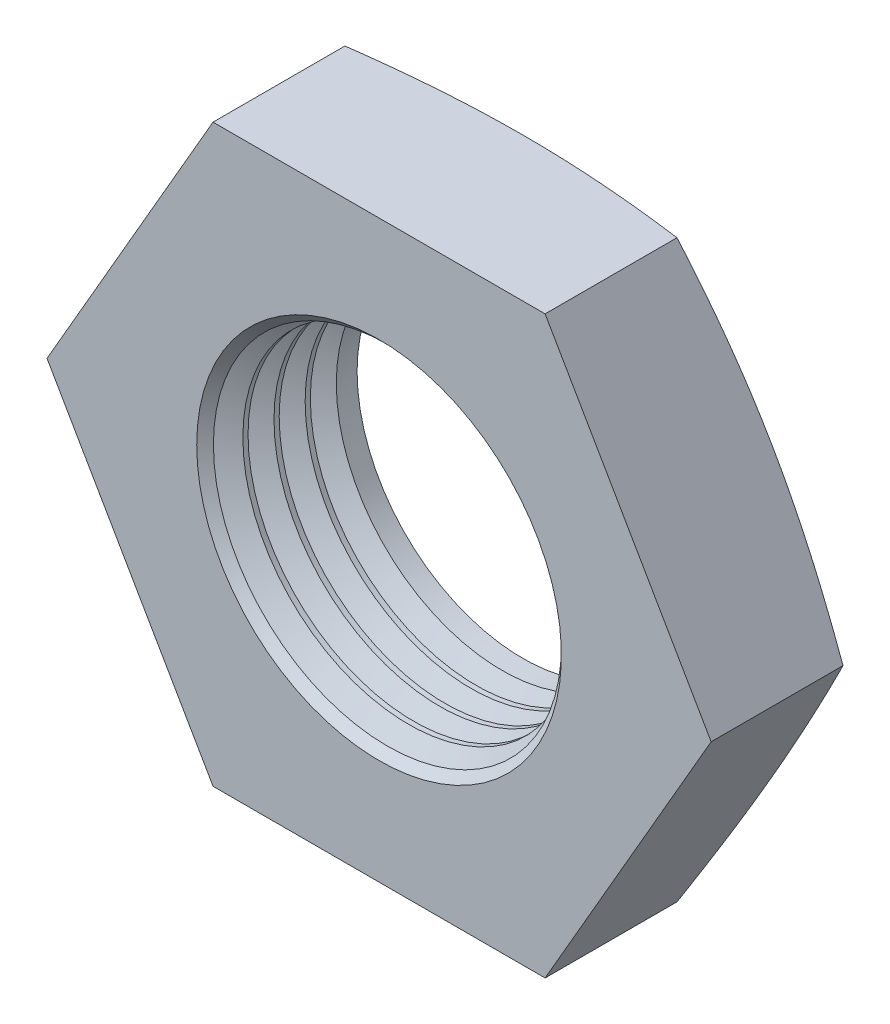
ISO-10303-21;
HEADER;
FILE_DESCRIPTION(('STEP AP214'),'2;1');
FILE_NAME('part.step','',(''),(''),'','','');
FILE_SCHEMA(('AUTOMOTIVE_DESIGN { 1 0 10303 214 1 1 1 1 }'));
ENDSEC;
DATA;
#1=APPLICATION_CONTEXT('core data for automotive mechanical design processes');
#2=APPLICATION_PROTOCOL_DEFINITION('international standard','automotive_design',2000,#1);
#3=PRODUCT_CONTEXT('',#1,'mechanical');
#4=PRODUCT('Part','Part','',(#3));
#5=PRODUCT_RELATED_PRODUCT_CATEGORY('part','',(#4));
#6=PRODUCT_DEFINITION_FORMATION('','',#4);
#7=PRODUCT_DEFINITION_CONTEXT('part definition',#1,'design');
#8=PRODUCT_DEFINITION('design','',#6,#7);
#9=PRODUCT_DEFINITION_SHAPE('','',#8);
#10=(LENGTH_UNIT() NAMED_UNIT(*) SI_UNIT(.MILLI.,.METRE.));
#11=(NAMED_UNIT(*) PLANE_ANGLE_UNIT() SI_UNIT($,.RADIAN.));
#12=(NAMED_UNIT(*) SI_UNIT($,.STERADIAN.) SOLID_ANGLE_UNIT());
#13=UNCERTAINTY_MEASURE_WITH_UNIT(LENGTH_MEASURE(1.E-05),#10,'distance_accuracy_value','');
#14=(GEOMETRIC_REPRESENTATION_CONTEXT(3) GLOBAL_UNCERTAINTY_ASSIGNED_CONTEXT((#13)) GLOBAL_UNIT_ASSIGNED_CONTEXT((#10,
#11,#12)) REPRESENTATION_CONTEXT('',''));
#15=CARTESIAN_POINT('',(0.,0.,0.));
#16=DIRECTION('',(0.,0.,1.));
#17=DIRECTION('',(1.,0.,0.));
#18=AXIS2_PLACEMENT_3D('',#15,#16,#17);
#19=CARTESIAN_POINT('',(0.,0.,-3.));
#20=DIRECTION('',(0.,0.,1.));
#21=DIRECTION('',(1.,0.,0.));
#22=AXIS2_PLACEMENT_3D('',#19,#20,#21);
#23=CYLINDRICAL_SURFACE('',#22,3.4585);
#24=CARTESIAN_POINT('',(0.,0.,-3.));
#25=DIRECTION('',(0.,0.,1.));
#26=DIRECTION('',(1.,0.,0.));
#27=AXIS2_PLACEMENT_3D('',#24,#25,#26);
#28=CIRCLE('',#27,3.4585);
#29=CARTESIAN_POINT('',(3.4585,0.,-3.));
#30=VERTEX_POINT('',#29);
#31=EDGE_CURVE('E304',#30,#30,#28,.T.);
#32=ORIENTED_EDGE('',*,*,#31,.F.);
#33=EDGE_LOOP('',(#32));
#34=FACE_BOUND('',#33,.T.);
#35=CARTESIAN_POINT('',(0.,0.,-2.56599999999999));
#36=DIRECTION('',(0.,0.,-1.));
#37=DIRECTION('',(-1.,0.,0.));
#38=AXIS2_PLACEMENT_3D('',#35,#36,#37);
#39=CIRCLE('',#38,3.4585);
#40=CARTESIAN_POINT('',(-3.4585,0.,-2.56599999999999));
#41=VERTEX_POINT('',#40);
#42=EDGE_CURVE('E468',#41,#41,#39,.T.);
#43=ORIENTED_EDGE('',*,*,#42,.F.);
#44=EDGE_LOOP('',(#43));
#45=FACE_BOUND('',#44,.T.);
#46=ADVANCED_FACE('F32',(#34,#45),#23,.F.);
#47=CARTESIAN_POINT('',(0.,0.,-1.91619999999999));
#48=DIRECTION('',(0.,0.,-1.));
#49=DIRECTION('',(-1.,0.,0.));
#50=AXIS2_PLACEMENT_3D('',#47,#48,#49);
#51=CIRCLE('',#50,3.4585);
#52=CARTESIAN_POINT('',(-3.4585,0.,-1.91619999999999));
#53=VERTEX_POINT('',#52);
#54=EDGE_CURVE('E242',#53,#53,#51,.T.);
#55=ORIENTED_EDGE('',*,*,#54,.F.);
#56=EDGE_LOOP('',(#55));
#57=FACE_BOUND('',#56,.T.);
#58=CARTESIAN_POINT('',(0.,0.,-2.02449999999999));
#59=DIRECTION('',(0.,0.,-1.));
#60=DIRECTION('',(-1.,0.,0.));
#61=AXIS2_PLACEMENT_3D('',#58,#59,#60);
#62=CIRCLE('',#61,3.4585);
#63=CARTESIAN_POINT('',(-3.4585,0.,-2.02449999999999));
#64=VERTEX_POINT('',#63);
#65=EDGE_CURVE('E465',#64,#64,#62,.T.);
#66=ORIENTED_EDGE('',*,*,#65,.T.);
#67=EDGE_LOOP('',(#66));
#68=FACE_BOUND('',#67,.T.);
#69=ADVANCED_FACE('F216',(#57,#68),#23,.F.);
#70=CARTESIAN_POINT('',(0.,0.,-1.26639999999999));
#71=DIRECTION('',(0.,0.,-1.));
#72=DIRECTION('',(-1.,0.,0.));
#73=AXIS2_PLACEMENT_3D('',#70,#71,#72);
#74=CIRCLE('',#73,3.4585);
#75=CARTESIAN_POINT('',(-3.4585,0.,-1.26639999999999));
#76=VERTEX_POINT('',#75);
#77=EDGE_CURVE('E245',#76,#76,#74,.T.);
#78=ORIENTED_EDGE('',*,*,#77,.F.);
#79=EDGE_LOOP('',(#78));
#80=FACE_BOUND('',#79,.T.);
#81=CARTESIAN_POINT('',(0.,0.,-1.37469999999999));
#82=DIRECTION('',(0.,0.,-1.));
#83=DIRECTION('',(-1.,0.,0.));
#84=AXIS2_PLACEMENT_3D('',#81,#82,#83);
#85=CIRCLE('',#84,3.4585);
#86=CARTESIAN_POINT('',(-3.4585,0.,-1.37469999999999));
#87=VERTEX_POINT('',#86);
#88=EDGE_CURVE('E473',#87,#87,#85,.T.);
#89=ORIENTED_EDGE('',*,*,#88,.T.);
#90=EDGE_LOOP('',(#89));
#91=FACE_BOUND('',#90,.T.);
#92=ADVANCED_FACE('F222',(#80,#91),#23,.F.);
#93=CARTESIAN_POINT('',(0.,0.,-0.616599999999994));
#94=DIRECTION('',(0.,0.,-1.));
#95=DIRECTION('',(-1.,0.,0.));
#96=AXIS2_PLACEMENT_3D('',#93,#94,#95);
#97=CIRCLE('',#96,3.4585);
#98=CARTESIAN_POINT('',(-3.4585,0.,-0.616599999999994));
#99=VERTEX_POINT('',#98);
#100=EDGE_CURVE('E236',#99,#99,#97,.T.);
#101=ORIENTED_EDGE('',*,*,#100,.F.);
#102=EDGE_LOOP('',(#101));
#103=FACE_BOUND('',#102,.T.);
#104=CARTESIAN_POINT('',(0.,0.,-0.724899999999994));
#105=DIRECTION('',(0.,0.,-1.));
#106=DIRECTION('',(-1.,0.,0.));
#107=AXIS2_PLACEMENT_3D('',#104,#105,#106);
#108=CIRCLE('',#107,3.4585);
#109=CARTESIAN_POINT('',(-3.4585,0.,-0.724899999999994));
#110=VERTEX_POINT('',#109);
#111=EDGE_CURVE('E239',#110,#110,#108,.T.);
#112=ORIENTED_EDGE('',*,*,#111,.T.);
#113=EDGE_LOOP('',(#112));
#114=FACE_BOUND('',#113,.T.);
#115=ADVANCED_FACE('F213',(#103,#114),#23,.F.);
#116=CARTESIAN_POINT('',(0.,0.,-0.345849999999994));
#117=DIRECTION('',(0.,0.,1.));
#118=DIRECTION('',(1.,0.,0.));
#119=AXIS2_PLACEMENT_3D('',#116,#117,#118);
#120=CONICAL_SURFACE('',#119,3.4585,0.78539816339745);
#121=CARTESIAN_POINT('',(0.,0.,0.));
#122=DIRECTION('',(0.,0.,-1.));
#123=DIRECTION('',(-1.,0.,0.));
#124=AXIS2_PLACEMENT_3D('',#121,#122,#123);
#125=CIRCLE('',#124,3.80434999999999);
#126=CARTESIAN_POINT('',(-3.80434999999999,0.,0.));
#127=VERTEX_POINT('',#126);
#128=EDGE_CURVE('E11',#127,#127,#125,.T.);
#129=ORIENTED_EDGE('',*,*,#128,.F.);
#130=EDGE_LOOP('',(#129));
#131=FACE_BOUND('',#130,.T.);
#132=CARTESIAN_POINT('',(0.,0.,-0.174201378074631));
#133=DIRECTION('',(0.,0.,-1.));
#134=DIRECTION('',(-1.,0.,0.));
#135=AXIS2_PLACEMENT_3D('',#132,#133,#134);
#136=CIRCLE('',#135,3.63014862192536);
#137=CARTESIAN_POINT('',(-3.63014862192536,0.,-0.174201378074631));
#138=VERTEX_POINT('',#137);
#139=EDGE_CURVE('E36',#138,#138,#136,.T.);
#140=ORIENTED_EDGE('',*,*,#139,.T.);
#141=EDGE_LOOP('',(#140));
#142=FACE_BOUND('',#141,.T.);
#143=ADVANCED_FACE('F34',(#131,#142),#120,.F.);
#144=CARTESIAN_POINT('',(-3.46410161513775,-6.,-3.));
#145=DIRECTION('',(0.,-1.,0.));
#146=DIRECTION('',(1.,0.,0.));
#147=AXIS2_PLACEMENT_3D('',#144,#145,#146);
#148=PLANE('',#147);
#149=CARTESIAN_POINT('',(-9.15858130450611,-6.,-1.67393155430563));
#150=CARTESIAN_POINT('',(-8.88643801079371,-6.,-1.73491174940811));
#151=CARTESIAN_POINT('',(-8.61412435451528,-6.,-1.79514527466442));
#152=CARTESIAN_POINT('',(-8.06907266084033,-6.,-1.91371595921941));
#153=CARTESIAN_POINT('',(-7.79633460561273,-6.,-1.97205303645412));
#154=CARTESIAN_POINT('',(-7.25010541937753,-6.,-2.08647871419722));
#155=CARTESIAN_POINT('',(-6.97661381147518,-6.,-2.14256504628228));
#156=CARTESIAN_POINT('',(-6.4290609665723,-6.,-2.25188300356124));
#157=CARTESIAN_POINT('',(-6.15499973441073,-6.,-2.30511465290347));
#158=CARTESIAN_POINT('',(-5.60839599903678,-6.,-2.40763302395546));
#159=CARTESIAN_POINT('',(-5.33585878058234,-6.,-2.45694778411602));
#160=CARTESIAN_POINT('',(-4.79004065503785,-6.,-2.55126612094932));
#161=CARTESIAN_POINT('',(-4.51675976447236,-6.,-2.59626979262385));
#162=CARTESIAN_POINT('',(-3.96940186106565,-6.,-2.680951545843));
#163=CARTESIAN_POINT('',(-3.69532495194099,-6.,-2.72063029196064));
#164=CARTESIAN_POINT('',(-3.14629914168248,-6.,-2.79349197351576));
#165=CARTESIAN_POINT('',(-2.8713502397618,-6.,-2.82667490309012));
#166=CARTESIAN_POINT('',(-2.31748061932898,-6.,-2.88560420237012));
#167=CARTESIAN_POINT('',(-2.03855030020603,-6.,-2.91126167691242));
#168=CARTESIAN_POINT('',(-1.47998956390074,-6.,-2.95336936544702));
#169=CARTESIAN_POINT('',(-1.20035916292119,-6.,-2.96981979058558));
#170=CARTESIAN_POINT('',(-0.64080376133714,-6.,-2.99255386747828));
#171=CARTESIAN_POINT('',(-0.360878951514298,-6.,-2.99884212039234));
#172=CARTESIAN_POINT('',(0.199009371930999,-6.,-3.00086536205332));
#173=CARTESIAN_POINT('',(0.47897288552336,-6.,-2.99660035896021));
#174=CARTESIAN_POINT('',(1.03956429097389,-6.,-2.97775695526949));
#175=CARTESIAN_POINT('',(1.3201908989832,-6.,-2.96314112450439));
#176=CARTESIAN_POINT('',(1.88078345342903,-6.,-2.9244298469494));
#177=CARTESIAN_POINT('',(2.1607493851276,-6.,-2.90033419066342));
#178=CARTESIAN_POINT('',(2.72001838529546,-6.,-2.84387910350285));
#179=CARTESIAN_POINT('',(2.99932090208969,-6.,-2.81151429109807));
#180=CARTESIAN_POINT('',(3.55702727030818,-6.,-2.73986600961093));
#181=CARTESIAN_POINT('',(3.83543111891444,-6.,-2.70058251885484));
#182=CARTESIAN_POINT('',(4.3727136263029,-6.,-2.61917849906481));
#183=CARTESIAN_POINT('',(4.63164852110481,-6.,-2.57742539473074));
#184=CARTESIAN_POINT('',(5.1488367537134,-6.,-2.48987348587896));
#185=CARTESIAN_POINT('',(5.40709007281589,-6.,-2.4440745714987));
#186=CARTESIAN_POINT('',(5.9230093806953,-6.,-2.3491704443359));
#187=CARTESIAN_POINT('',(6.18067531496378,-6.,-2.30006493666402));
#188=CARTESIAN_POINT('',(6.69547854916198,-6.,-2.19915059117074));
#189=CARTESIAN_POINT('',(6.95261584221859,-6.,-2.14734171842977));
#190=CARTESIAN_POINT('',(7.72346122122508,-6.,-1.98859381593425));
#191=CARTESIAN_POINT('',(8.23648902924428,-6.,-1.87835491013529));
#192=CARTESIAN_POINT('',(9.26118111769937,-6.,-1.65191083602214));
#193=CARTESIAN_POINT('',(9.77284547571088,-6.,-1.53570601511627));
#194=CARTESIAN_POINT('',(10.790174893646,-6.,-1.30025462322199));
#195=CARTESIAN_POINT('',(11.2958494956431,-6.,-1.18104916755321));
#196=CARTESIAN_POINT('',(12.3064931125278,-6.,-0.939652794083793));
#197=CARTESIAN_POINT('',(12.8114621144394,-6.,-0.817461822123468));
#198=CARTESIAN_POINT('',(13.8202393644341,-6.,-0.57102514029176));
#199=CARTESIAN_POINT('',(14.3240482762932,-6.,-0.44678214214122));
#200=CARTESIAN_POINT('',(15.3312270578021,-6.,-0.196598337587482));
#201=CARTESIAN_POINT('',(15.8345969413604,-6.,-0.0706575872157296));
#202=CARTESIAN_POINT('',(16.337813744352,-5.99999999999999,0.0558845876254234));
#203=B_SPLINE_CURVE_WITH_KNOTS('',3,(#149,#150,#151,#152,#153,#154,#155,#156,#157,#158,#159,
#160,#161,#162,#163,#164,#165,#166,#167,#168,#169,#170,#171,#172,#173,#174,#175,#176,#177,#178,
#179,#180,#181,#182,#183,#184,#185,#186,#187,#188,#189,#190,#191,#192,#193,#194,#195,#196,#197,
#198,#199,#200,#201,#202),.UNSPECIFIED.,.F.,.F.,(4,2,2,2,2,2,2,2,2,2,2,2,2,2,2,2,2,2,2,2,2,2,2,
2,2,2,4),(0.,0.836678383826137,1.67339292472048,2.51093059339313,3.34846117604975,
4.17932240063241,5.01016531163245,5.84090443333288,6.67164430485582,7.51183493108893,
8.35200628835078,9.19179713179479,10.0315873258978,10.8744299386385,11.7172911785313,
12.560702352224,13.4041161680677,14.1909172558106,14.9777397154337,15.7646324388047,
16.5515353290489,18.1256883789567,19.6997498662211,21.258342415717,22.8169632603731,
24.3736673120881,25.9303201125864),.UNSPECIFIED.);
#204=CARTESIAN_POINT('',(3.46410161513776,-6.,-2.75128869403572));
#205=VERTEX_POINT('',#204);
#206=CARTESIAN_POINT('',(0.,-6.,-3.));
#207=VERTEX_POINT('',#206);
#208=EDGE_CURVE('E48',#205,#207,#203,.F.);
#209=ORIENTED_EDGE('',*,*,#208,.F.);
#210=DIRECTION('',(0.,0.,1.));
#211=VECTOR('',#210,1.);
#212=CARTESIAN_POINT('',(3.46410161513775,-6.,-3.));
#213=LINE('',#212,#211);
#214=CARTESIAN_POINT('',(3.46410161513775,-6.,0.));
#215=VERTEX_POINT('',#214);
#216=EDGE_CURVE('E317',#205,#215,#213,.T.);
#217=ORIENTED_EDGE('',*,*,#216,.T.);
#218=DIRECTION('',(1.,0.,0.));
#219=VECTOR('',#218,1.);
#220=CARTESIAN_POINT('',(-3.46410161513775,-6.,0.));
#221=LINE('',#220,#219);
#222=CARTESIAN_POINT('',(-3.46410161513775,-6.,0.));
#223=VERTEX_POINT('',#222);
#224=EDGE_CURVE('E298',#223,#215,#221,.T.);
#225=ORIENTED_EDGE('',*,*,#224,.F.);
#226=DIRECTION('',(0.,0.,1.));
#227=VECTOR('',#226,1.);
#228=CARTESIAN_POINT('',(-3.46410161513775,-6.,-3.));
#229=LINE('',#228,#227);
#230=CARTESIAN_POINT('',(-3.46410161513775,-6.,-2.75128869403572));
#231=VERTEX_POINT('',#230);
#232=EDGE_CURVE('E128',#231,#223,#229,.T.);
#233=ORIENTED_EDGE('',*,*,#232,.F.);
#234=EDGE_CURVE('E111',#207,#231,#203,.F.);
#235=ORIENTED_EDGE('',*,*,#234,.F.);
#236=EDGE_LOOP('',(#209,#217,#225,#233,#235));
#237=FACE_BOUND('',#236,.T.);
#238=ADVANCED_FACE('F205',(#237),#148,.T.);
#239=CARTESIAN_POINT('',(-6.92820323027551,0.,-3.));
#240=DIRECTION('',(-0.866025403784439,-0.5,0.));
#241=DIRECTION('',(0.5,-0.866025403784439,0.));
#242=AXIS2_PLACEMENT_3D('',#239,#240,#241);
#243=PLANE('',#242);
#244=CARTESIAN_POINT('',(-3.46398614508391,-6.0002,-2.75125775315456));
#245=CARTESIAN_POINT('',(-3.60785114953797,-5.75101850285446,-2.78982277668636));
#246=CARTESIAN_POINT('',(-3.75197700039366,-5.5013852064883,-2.82483347498253));
#247=CARTESIAN_POINT('',(-4.0407377014457,-5.00123700103696,-2.88634401426715));
#248=CARTESIAN_POINT('',(-4.18537273434947,-4.75072177549324,-2.91284039819726));
#249=CARTESIAN_POINT('',(-4.47427486270238,-4.25032861077121,-2.95577544587075));
#250=CARTESIAN_POINT('',(-4.61854000453067,-4.00045405536348,-2.97226531226336));
#251=CARTESIAN_POINT('',(-4.90725426581541,-3.5003862859486,-2.99437653789228));
#252=CARTESIAN_POINT('',(-5.05170334426102,-3.2501931429743,-3.));
#253=CARTESIAN_POINT('',(-5.34060150115224,-2.7498068570257,-3.));
#254=CARTESIAN_POINT('',(-5.48505057959785,-2.4996137140514,-2.99437653789228));
#255=CARTESIAN_POINT('',(-5.77376484088259,-1.99954594463652,-2.97226531226336));
#256=CARTESIAN_POINT('',(-5.91802998271088,-1.74967138922879,-2.95577544587075));
#257=CARTESIAN_POINT('',(-6.20693211106379,-1.24927822450676,-2.91284039819726));
#258=CARTESIAN_POINT('',(-6.35156714396756,-0.998762998963042,-2.88634401426715));
#259=CARTESIAN_POINT('',(-6.6403278450196,-0.498614793511701,-2.82483347498253));
#260=CARTESIAN_POINT('',(-6.78445369587529,-0.248981497145543,-2.78982277668636));
#261=CARTESIAN_POINT('',(-6.92831870032935,0.000199999999998929,-2.75125775315456));
#262=B_SPLINE_CURVE_WITH_KNOTS('',3,(#244,#245,#246,#247,#248,#249,#250,#251,#252,#253,#254,
#255,#256,#257,#258,#259,#260,#261),.UNSPECIFIED.,.F.,.F.,(4,2,2,2,2,2,2,2,4),(0.,
0.870954567248994,1.74226232176161,2.60907321145348,3.47571633871007,4.34235946596667,
5.20917035565854,6.08047811017116,6.95143267742015),.UNSPECIFIED.);
#263=CARTESIAN_POINT('',(-5.19615242270663,-3.,-3.));
#264=VERTEX_POINT('',#263);
#265=EDGE_CURVE('E105',#231,#264,#262,.T.);
#266=ORIENTED_EDGE('',*,*,#265,.F.);
#267=ORIENTED_EDGE('',*,*,#232,.T.);
#268=DIRECTION('',(0.5,-0.866025403784438,0.));
#269=VECTOR('',#268,1.);
#270=CARTESIAN_POINT('',(-6.92820323027551,0.,0.));
#271=LINE('',#270,#269);
#272=CARTESIAN_POINT('',(-6.92820323027551,0.,0.));
#273=VERTEX_POINT('',#272);
#274=EDGE_CURVE('E303',#273,#223,#271,.T.);
#275=ORIENTED_EDGE('',*,*,#274,.F.);
#276=DIRECTION('',(0.,0.,1.));
#277=VECTOR('',#276,1.);
#278=CARTESIAN_POINT('',(-6.92820323027551,0.,-3.));
#279=LINE('',#278,#277);
#280=CARTESIAN_POINT('',(-6.92820323027551,0.,-2.75128869403572));
#281=VERTEX_POINT('',#280);
#282=EDGE_CURVE('E136',#281,#273,#279,.T.);
#283=ORIENTED_EDGE('',*,*,#282,.F.);
#284=EDGE_CURVE('E115',#264,#281,#262,.T.);
#285=ORIENTED_EDGE('',*,*,#284,.F.);
#286=EDGE_LOOP('',(#266,#267,#275,#283,#285));
#287=FACE_BOUND('',#286,.T.);
#288=ADVANCED_FACE('F134',(#287),#243,.T.);
#289=CARTESIAN_POINT('',(-3.46410161513775,6.,-3.));
#290=DIRECTION('',(-0.866025403784438,0.5,0.));
#291=DIRECTION('',(-0.5,-0.866025403784439,0.));
#292=AXIS2_PLACEMENT_3D('',#289,#290,#291);
#293=PLANE('',#292);
#294=CARTESIAN_POINT('',(-6.92831870032935,-0.000199999999999144,-2.75125775315456));
#295=CARTESIAN_POINT('',(-6.7844536958753,0.248981497145543,-2.78982277668636));
#296=CARTESIAN_POINT('',(-6.6403278450196,0.498614793511702,-2.82483347498253));
#297=CARTESIAN_POINT('',(-6.35156714396756,0.998762998963043,-2.88634401426715));
#298=CARTESIAN_POINT('',(-6.2069321110638,1.24927822450676,-2.91284039819726));
#299=CARTESIAN_POINT('',(-5.91802998271088,1.74967138922879,-2.95577544587075));
#300=CARTESIAN_POINT('',(-5.77376484088259,1.99954594463652,-2.97226531226335));
#301=CARTESIAN_POINT('',(-5.48505057959785,2.4996137140514,-2.99437653789228));
#302=CARTESIAN_POINT('',(-5.34060150115224,2.7498068570257,-3.));
#303=CARTESIAN_POINT('',(-5.05170334426102,3.2501931429743,-3.));
#304=CARTESIAN_POINT('',(-4.90725426581541,3.5003862859486,-2.99437653789228));
#305=CARTESIAN_POINT('',(-4.61854000453068,4.00045405536348,-2.97226531226335));
#306=CARTESIAN_POINT('',(-4.47427486270238,4.25032861077121,-2.95577544587075));
#307=CARTESIAN_POINT('',(-4.18537273434947,4.75072177549324,-2.91284039819726));
#308=CARTESIAN_POINT('',(-4.04073770144571,5.00123700103696,-2.88634401426715));
#309=CARTESIAN_POINT('',(-3.75197700039366,5.5013852064883,-2.82483347498253));
#310=CARTESIAN_POINT('',(-3.60785114953797,5.75101850285446,-2.78982277668636));
#311=CARTESIAN_POINT('',(-3.46398614508392,6.0002,-2.75125775315456));
#312=B_SPLINE_CURVE_WITH_KNOTS('',3,(#294,#295,#296,#297,#298,#299,#300,#301,#302,#303,#304,
#305,#306,#307,#308,#309,#310,#311),.UNSPECIFIED.,.F.,.F.,(4,2,2,2,2,2,2,2,4),(0.,
0.870954567248994,1.74226232176161,2.60907321145348,3.47571633871007,4.34235946596667,
5.20917035565854,6.08047811017116,6.95143267742015),.UNSPECIFIED.);
#313=CARTESIAN_POINT('',(-5.19615242270663,3.,-3.));
#314=VERTEX_POINT('',#313);
#315=EDGE_CURVE('E123',#281,#314,#312,.T.);
#316=ORIENTED_EDGE('',*,*,#315,.F.);
#317=ORIENTED_EDGE('',*,*,#282,.T.);
#318=DIRECTION('',(-0.5,-0.866025403784439,0.));
#319=VECTOR('',#318,1.);
#320=CARTESIAN_POINT('',(-3.46410161513775,6.,0.));
#321=LINE('',#320,#319);
#322=CARTESIAN_POINT('',(-3.46410161513775,6.,0.));
#323=VERTEX_POINT('',#322);
#324=EDGE_CURVE('E314',#323,#273,#321,.T.);
#325=ORIENTED_EDGE('',*,*,#324,.F.);
#326=DIRECTION('',(0.,0.,1.));
#327=VECTOR('',#326,1.);
#328=CARTESIAN_POINT('',(-3.46410161513775,6.,-3.));
#329=LINE('',#328,#327);
#330=CARTESIAN_POINT('',(-3.46410161513776,6.,-2.75128869403572));
#331=VERTEX_POINT('',#330);
#332=EDGE_CURVE('E320',#331,#323,#329,.T.);
#333=ORIENTED_EDGE('',*,*,#332,.F.);
#334=EDGE_CURVE('E137',#314,#331,#312,.T.);
#335=ORIENTED_EDGE('',*,*,#334,.F.);
#336=EDGE_LOOP('',(#316,#317,#325,#333,#335));
#337=FACE_BOUND('',#336,.T.);
#338=ADVANCED_FACE('F195',(#337),#293,.T.);
#339=CARTESIAN_POINT('',(3.46410161513775,6.,-3.));
#340=DIRECTION('',(0.,1.,0.));
#341=DIRECTION('',(0.,0.,1.));
#342=AXIS2_PLACEMENT_3D('',#339,#340,#341);
#343=PLANE('',#342);
#344=CARTESIAN_POINT('',(-9.15858068988906,6.,-1.67393169206229));
#345=CARTESIAN_POINT('',(-8.88643742101571,6.,-1.73491188037167));
#346=CARTESIAN_POINT('',(-8.61412378958548,6.,-1.79514539885956));
#347=CARTESIAN_POINT('',(-8.06907214563937,6.,-1.91371606997813));
#348=CARTESIAN_POINT('',(-7.7963341152924,6.,-1.97205314054485));
#349=CARTESIAN_POINT('',(-7.25010497894587,6.,-2.08647880508531));
#350=CARTESIAN_POINT('',(-6.97661339605169,6.,-2.14256513063637));
#351=CARTESIAN_POINT('',(-6.42906060122756,6.,-2.25188307508478));
#352=CARTESIAN_POINT('',(-6.15499939413655,6.,-2.30511471813047));
#353=CARTESIAN_POINT('',(-5.6083957083319,6.,-2.40763307708303));
#354=CARTESIAN_POINT('',(-5.33585851437441,6.,-2.45694783143201));
#355=CARTESIAN_POINT('',(-4.79004043793214,6.,-2.5512661571507));
#356=CARTESIAN_POINT('',(-4.51675957197192,6.,-2.59626982352219));
#357=CARTESIAN_POINT('',(-3.96940171789566,6.,-2.68095156687664));
#358=CARTESIAN_POINT('',(-3.69532483349613,6.,-2.72063030843223));
#359=CARTESIAN_POINT('',(-3.14629907284695,6.,-2.79349198189872));
#360=CARTESIAN_POINT('',(-2.87135019581047,6.,-2.8266749079465));
#361=CARTESIAN_POINT('',(-2.317480627973,6.,-2.8856042012684));
#362=CARTESIAN_POINT('',(-2.03855033657036,6.,-2.91126167346307));
#363=CARTESIAN_POINT('',(-1.47998965582791,6.,-2.95336935922424));
#364=CARTESIAN_POINT('',(-1.20035928269088,6.,-2.96981978393682));
#365=CARTESIAN_POINT('',(-0.640803936781287,6.,-2.99255386213073));
#366=CARTESIAN_POINT('',(-0.360879154790332,6.,-2.99884211677015));
#367=CARTESIAN_POINT('',(0.199009113092941,6.,-3.00086536400539));
#368=CARTESIAN_POINT('',(0.478972598955164,6.,-2.99660036476122));
#369=CARTESIAN_POINT('',(1.03956394895034,6.,-2.97775697061385));
#370=CARTESIAN_POINT('',(1.32019052923532,6.,-2.96314114555356));
#371=CARTESIAN_POINT('',(1.88078302848166,6.,-2.92442988078197));
#372=CARTESIAN_POINT('',(2.16074893270508,6.,-2.9003342315747));
#373=CARTESIAN_POINT('',(2.72001787808391,6.,-2.84387915946884));
#374=CARTESIAN_POINT('',(2.99932036756459,6.,-2.8115143550423));
#375=CARTESIAN_POINT('',(3.5570266813395,6.,-2.73986609000478));
#376=CARTESIAN_POINT('',(3.83543050281574,6.,-2.70058260772006));
#377=CARTESIAN_POINT('',(4.37271298373212,6.,-2.61917860060076));
#378=CARTESIAN_POINT('',(4.63164787910858,6.,-2.57742549996053));
#379=CARTESIAN_POINT('',(5.14883611280752,6.,-2.4898735978245));
#380=CARTESIAN_POINT('',(5.4070894324258,6.,-2.44407468646608));
#381=CARTESIAN_POINT('',(5.92300874128119,6.,-2.34917056479165));
#382=CARTESIAN_POINT('',(6.18067467600982,6.,-2.30006505958613));
#383=CARTESIAN_POINT('',(6.69547791106519,6.,-2.19915071857657));
#384=CARTESIAN_POINT('',(6.9526152045188,6.,-2.14734184785294));
#385=CARTESIAN_POINT('',(7.72346058483834,6.,-1.98859395083216));
#386=CARTESIAN_POINT('',(8.23648839368683,6.,-1.87835504795143));
#387=CARTESIAN_POINT('',(9.261180483614,6.,-1.65191097876661));
#388=CARTESIAN_POINT('',(9.77284484226833,6.,-1.53570615987105));
#389=CARTESIAN_POINT('',(10.7901742621509,6.,-1.30025477120519));
#390=CARTESIAN_POINT('',(11.2958488654523,6.,-1.18104931675389));
#391=CARTESIAN_POINT('',(12.3064924848617,6.,-0.939652945323227));
#392=CARTESIAN_POINT('',(12.8114614879936,6.,-0.817461974184136));
#393=CARTESIAN_POINT('',(13.8202387399914,6.,-0.571025293816399));
#394=CARTESIAN_POINT('',(14.3240476526336,6.,-0.44678229631056));
#395=CARTESIAN_POINT('',(15.3312264356585,6.,-0.196598492856118));
#396=CARTESIAN_POINT('',(15.8345963199497,6.,-0.0706577429389848));
#397=CARTESIAN_POINT('',(16.3378131236596,6.,0.055884431506369));
#398=B_SPLINE_CURVE_WITH_KNOTS('',3,(#344,#345,#346,#347,#348,#349,#350,#351,#352,#353,#354,
#355,#356,#357,#358,#359,#360,#361,#362,#363,#364,#365,#366,#367,#368,#369,#370,#371,#372,#373,
#374,#375,#376,#377,#378,#379,#380,#381,#382,#383,#384,#385,#386,#387,#388,#389,#390,#391,#392,
#393,#394,#395,#396,#397),.UNSPECIFIED.,.F.,.F.,(4,2,2,2,2,2,2,2,2,2,2,2,2,2,2,2,2,2,2,2,2,2,2,
2,2,2,4),(0.,0.83667830665573,1.67339277037525,2.51093036161565,3.34846086684044,
4.1793220160057,5.01016485159279,5.84090389793543,6.67164369409842,7.51183423691594,
8.35200551077459,9.1917962709224,10.0315863817248,10.8744289105553,11.7172900665271,
12.5607011560768,13.4041148877793,14.1909159754459,14.9777384350014,15.7646311583374,
16.5515340485501,18.1256870990316,19.6997485868351,21.2583411392979,22.8169619869313,
24.3736660404637,25.9303188427627),.UNSPECIFIED.);
#399=CARTESIAN_POINT('',(0.,6.,-3.));
#400=VERTEX_POINT('',#399);
#401=EDGE_CURVE('E190',#331,#400,#398,.T.);
#402=ORIENTED_EDGE('',*,*,#401,.F.);
#403=ORIENTED_EDGE('',*,*,#332,.T.);
#404=DIRECTION('',(-1.,0.,0.));
#405=VECTOR('',#404,1.);
#406=CARTESIAN_POINT('',(3.46410161513775,6.,0.));
#407=LINE('',#406,#405);
#408=CARTESIAN_POINT('',(3.46410161513775,6.,0.));
#409=VERTEX_POINT('',#408);
#410=EDGE_CURVE('E311',#409,#323,#407,.T.);
#411=ORIENTED_EDGE('',*,*,#410,.F.);
#412=DIRECTION('',(0.,0.,1.));
#413=VECTOR('',#412,1.);
#414=CARTESIAN_POINT('',(3.46410161513775,6.,-3.));
#415=LINE('',#414,#413);
#416=CARTESIAN_POINT('',(3.46410161513775,6.,-2.75128869403572));
#417=VERTEX_POINT('',#416);
#418=EDGE_CURVE('E322',#417,#409,#415,.T.);
#419=ORIENTED_EDGE('',*,*,#418,.F.);
#420=EDGE_CURVE('E185',#400,#417,#398,.T.);
#421=ORIENTED_EDGE('',*,*,#420,.F.);
#422=EDGE_LOOP('',(#402,#403,#411,#419,#421));
#423=FACE_BOUND('',#422,.T.);
#424=ADVANCED_FACE('F191',(#423),#343,.T.);
#425=CARTESIAN_POINT('',(6.92820323027551,0.,-3.));
#426=DIRECTION('',(0.866025403784438,0.5,0.));
#427=DIRECTION('',(-0.5,0.866025403784438,0.));
#428=AXIS2_PLACEMENT_3D('',#425,#426,#427);
#429=PLANE('',#428);
#430=CARTESIAN_POINT('',(3.46398614508391,6.0002,-2.75125775315456));
#431=CARTESIAN_POINT('',(3.60785114953797,5.75101850285446,-2.78982277668636));
#432=CARTESIAN_POINT('',(3.75197700039366,5.5013852064883,-2.82483347498253));
#433=CARTESIAN_POINT('',(4.0407377014457,5.00123700103696,-2.88634401426715));
#434=CARTESIAN_POINT('',(4.18537273434947,4.75072177549324,-2.91284039819726));
#435=CARTESIAN_POINT('',(4.47427486270238,4.25032861077121,-2.95577544587075));
#436=CARTESIAN_POINT('',(4.61854000453067,4.00045405536348,-2.97226531226336));
#437=CARTESIAN_POINT('',(4.90725426581541,3.5003862859486,-2.99437653789228));
#438=CARTESIAN_POINT('',(5.05170334426102,3.2501931429743,-3.));
#439=CARTESIAN_POINT('',(5.34060150115224,2.74980685702571,-3.));
#440=CARTESIAN_POINT('',(5.48505057959785,2.49961371405141,-2.99437653789228));
#441=CARTESIAN_POINT('',(5.77376484088259,1.99954594463653,-2.97226531226335));
#442=CARTESIAN_POINT('',(5.91802998271088,1.74967138922879,-2.95577544587075));
#443=CARTESIAN_POINT('',(6.20693211106379,1.24927822450676,-2.91284039819726));
#444=CARTESIAN_POINT('',(6.35156714396756,0.998762998963047,-2.88634401426715));
#445=CARTESIAN_POINT('',(6.6403278450196,0.498614793511705,-2.82483347498253));
#446=CARTESIAN_POINT('',(6.78445369587529,0.248981497145546,-2.78982277668636));
#447=CARTESIAN_POINT('',(6.92831870032935,-0.000199999999994988,-2.75125775315456));
#448=B_SPLINE_CURVE_WITH_KNOTS('',3,(#430,#431,#432,#433,#434,#435,#436,#437,#438,#439,#440,
#441,#442,#443,#444,#445,#446,#447),.UNSPECIFIED.,.F.,.F.,(4,2,2,2,2,2,2,2,4),(0.,
0.870954567248993,1.74226232176161,2.60907321145348,3.47571633871007,4.34235946596667,
5.20917035565854,6.08047811017115,6.95143267742015),.UNSPECIFIED.);
#449=CARTESIAN_POINT('',(5.19615242270663,3.,-3.));
#450=VERTEX_POINT('',#449);
#451=EDGE_CURVE('E56',#417,#450,#448,.T.);
#452=ORIENTED_EDGE('',*,*,#451,.F.);
#453=ORIENTED_EDGE('',*,*,#418,.T.);
#454=DIRECTION('',(-0.5,0.866025403784438,0.));
#455=VECTOR('',#454,1.);
#456=CARTESIAN_POINT('',(6.92820323027551,0.,0.));
#457=LINE('',#456,#455);
#458=CARTESIAN_POINT('',(6.92820323027551,0.,0.));
#459=VERTEX_POINT('',#458);
#460=EDGE_CURVE('E306',#459,#409,#457,.T.);
#461=ORIENTED_EDGE('',*,*,#460,.F.);
#462=DIRECTION('',(0.,0.,1.));
#463=VECTOR('',#462,1.);
#464=CARTESIAN_POINT('',(6.92820323027551,0.,-3.));
#465=LINE('',#464,#463);
#466=CARTESIAN_POINT('',(6.92820323027551,0.,-2.75128869403572));
#467=VERTEX_POINT('',#466);
#468=EDGE_CURVE('E324',#467,#459,#465,.T.);
#469=ORIENTED_EDGE('',*,*,#468,.F.);
#470=EDGE_CURVE('E179',#450,#467,#448,.T.);
#471=ORIENTED_EDGE('',*,*,#470,.F.);
#472=EDGE_LOOP('',(#452,#453,#461,#469,#471));
#473=FACE_BOUND('',#472,.T.);
#474=ADVANCED_FACE('F194',(#473),#429,.T.);
#475=CARTESIAN_POINT('',(3.46410161513775,-6.,-3.));
#476=DIRECTION('',(0.866025403784439,-0.5,0.));
#477=DIRECTION('',(0.5,0.866025403784439,0.));
#478=AXIS2_PLACEMENT_3D('',#475,#476,#477);
#479=PLANE('',#478);
#480=CARTESIAN_POINT('',(6.92831870032935,0.00020000000000295,-2.75125775315456));
#481=CARTESIAN_POINT('',(6.7844536958753,-0.248981497145539,-2.78982277668636));
#482=CARTESIAN_POINT('',(6.6403278450196,-0.498614793511698,-2.82483347498253));
#483=CARTESIAN_POINT('',(6.35156714396756,-0.998762998963038,-2.88634401426715));
#484=CARTESIAN_POINT('',(6.20693211106379,-1.24927822450676,-2.91284039819726));
#485=CARTESIAN_POINT('',(5.91802998271088,-1.74967138922878,-2.95577544587075));
#486=CARTESIAN_POINT('',(5.77376484088259,-1.99954594463652,-2.97226531226336));
#487=CARTESIAN_POINT('',(5.48505057959785,-2.4996137140514,-2.99437653789228));
#488=CARTESIAN_POINT('',(5.34060150115224,-2.7498068570257,-3.));
#489=CARTESIAN_POINT('',(5.05170334426102,-3.25019314297429,-3.));
#490=CARTESIAN_POINT('',(4.90725426581541,-3.50038628594859,-2.99437653789228));
#491=CARTESIAN_POINT('',(4.61854000453068,-4.00045405536348,-2.97226531226336));
#492=CARTESIAN_POINT('',(4.47427486270238,-4.25032861077121,-2.95577544587075));
#493=CARTESIAN_POINT('',(4.18537273434947,-4.75072177549324,-2.91284039819726));
#494=CARTESIAN_POINT('',(4.04073770144571,-5.00123700103696,-2.88634401426715));
#495=CARTESIAN_POINT('',(3.75197700039366,-5.5013852064883,-2.82483347498253));
#496=CARTESIAN_POINT('',(3.60785114953797,-5.75101850285446,-2.78982277668636));
#497=CARTESIAN_POINT('',(3.46398614508392,-6.0002,-2.75125775315456));
#498=B_SPLINE_CURVE_WITH_KNOTS('',3,(#480,#481,#482,#483,#484,#485,#486,#487,#488,#489,#490,
#491,#492,#493,#494,#495,#496,#497),.UNSPECIFIED.,.F.,.F.,(4,2,2,2,2,2,2,2,4),(0.,
0.870954567248994,1.74226232176161,2.60907321145348,3.47571633871008,4.34235946596667,
5.20917035565854,6.08047811017116,6.95143267742015),.UNSPECIFIED.);
#499=CARTESIAN_POINT('',(5.19615242270663,-3.,-3.));
#500=VERTEX_POINT('',#499);
#501=EDGE_CURVE('E260',#467,#500,#498,.T.);
#502=ORIENTED_EDGE('',*,*,#501,.F.);
#503=ORIENTED_EDGE('',*,*,#468,.T.);
#504=DIRECTION('',(0.5,0.866025403784439,0.));
#505=VECTOR('',#504,1.);
#506=CARTESIAN_POINT('',(3.46410161513775,-6.,0.));
#507=LINE('',#506,#505);
#508=EDGE_CURVE('E301',#215,#459,#507,.T.);
#509=ORIENTED_EDGE('',*,*,#508,.F.);
#510=ORIENTED_EDGE('',*,*,#216,.F.);
#511=EDGE_CURVE('E170',#500,#205,#498,.T.);
#512=ORIENTED_EDGE('',*,*,#511,.F.);
#513=EDGE_LOOP('',(#502,#503,#509,#510,#512));
#514=FACE_BOUND('',#513,.T.);
#515=ADVANCED_FACE('F200',(#514),#479,.T.);
#516=CARTESIAN_POINT('',(-3.46410161513775,-6.,-3.));
#517=DIRECTION('',(0.,0.,-1.));
#518=DIRECTION('',(-1.,0.,0.));
#519=AXIS2_PLACEMENT_3D('',#516,#517,#518);
#520=PLANE('',#519);
#521=CARTESIAN_POINT('',(0.,0.,-3.));
#522=DIRECTION('',(0.,0.,-1.));
#523=DIRECTION('',(-1.,0.,0.));
#524=AXIS2_PLACEMENT_3D('',#521,#522,#523);
#525=CIRCLE('',#524,6.);
#526=EDGE_CURVE('E41',#264,#207,#525,.F.);
#527=ORIENTED_EDGE('',*,*,#526,.F.);
#528=EDGE_CURVE('E120',#314,#264,#525,.F.);
#529=ORIENTED_EDGE('',*,*,#528,.F.);
#530=CARTESIAN_POINT('',(0.,0.,-3.));
#531=DIRECTION('',(0.,0.,-1.));
#532=DIRECTION('',(-1.,0.,0.));
#533=AXIS2_PLACEMENT_3D('',#530,#531,#532);
#534=CIRCLE('',#533,6.);
#535=EDGE_CURVE('E257',#314,#400,#534,.T.);
#536=ORIENTED_EDGE('',*,*,#535,.T.);
#537=EDGE_CURVE('E127',#450,#400,#525,.F.);
#538=ORIENTED_EDGE('',*,*,#537,.F.);
#539=EDGE_CURVE('E339',#500,#450,#525,.F.);
#540=ORIENTED_EDGE('',*,*,#539,.F.);
#541=EDGE_CURVE('E132',#207,#500,#525,.F.);
#542=ORIENTED_EDGE('',*,*,#541,.F.);
#543=EDGE_LOOP('',(#527,#529,#536,#538,#540,#542));
#544=FACE_BOUND('',#543,.T.);
#545=ORIENTED_EDGE('',*,*,#31,.T.);
#546=EDGE_LOOP('',(#545));
#547=FACE_BOUND('',#546,.T.);
#548=ADVANCED_FACE('F130',(#544,#547),#520,.T.);
#549=CARTESIAN_POINT('',(-3.46410161513775,-6.,0.));
#550=DIRECTION('',(0.,0.,-1.));
#551=DIRECTION('',(-1.,0.,0.));
#552=AXIS2_PLACEMENT_3D('',#549,#550,#551);
#553=PLANE('',#552);
#554=ORIENTED_EDGE('',*,*,#128,.T.);
#555=EDGE_LOOP('',(#554));
#556=FACE_BOUND('',#555,.T.);
#557=ORIENTED_EDGE('',*,*,#224,.T.);
#558=ORIENTED_EDGE('',*,*,#508,.T.);
#559=ORIENTED_EDGE('',*,*,#460,.T.);
#560=ORIENTED_EDGE('',*,*,#410,.T.);
#561=ORIENTED_EDGE('',*,*,#324,.T.);
#562=ORIENTED_EDGE('',*,*,#274,.T.);
#563=EDGE_LOOP('',(#557,#558,#559,#560,#561,#562));
#564=FACE_BOUND('',#563,.T.);
#565=ADVANCED_FACE('F282',(#556,#564),#553,.F.);
#566=CARTESIAN_POINT('',(0.,0.,-2.75128869403572));
#567=DIRECTION('',(0.,0.,1.));
#568=DIRECTION('',(1.,0.,0.));
#569=AXIS2_PLACEMENT_3D('',#566,#567,#568);
#570=CONICAL_SURFACE('',#569,6.92820323027551,1.30899693899575);
#571=ORIENTED_EDGE('',*,*,#284,.T.);
#572=ORIENTED_EDGE('',*,*,#315,.T.);
#573=ORIENTED_EDGE('',*,*,#528,.T.);
#574=EDGE_LOOP('',(#571,#572,#573));
#575=FACE_BOUND('',#574,.T.);
#576=ADVANCED_FACE('F121',(#575),#570,.T.);
#577=ORIENTED_EDGE('',*,*,#334,.T.);
#578=ORIENTED_EDGE('',*,*,#401,.T.);
#579=ORIENTED_EDGE('',*,*,#535,.F.);
#580=EDGE_LOOP('',(#577,#578,#579));
#581=FACE_BOUND('',#580,.T.);
#582=ADVANCED_FACE('F281',(#581),#570,.T.);
#583=ORIENTED_EDGE('',*,*,#420,.T.);
#584=ORIENTED_EDGE('',*,*,#451,.T.);
#585=ORIENTED_EDGE('',*,*,#537,.T.);
#586=EDGE_LOOP('',(#583,#584,#585));
#587=FACE_BOUND('',#586,.T.);
#588=ADVANCED_FACE('F162',(#587),#570,.T.);
#589=ORIENTED_EDGE('',*,*,#470,.T.);
#590=ORIENTED_EDGE('',*,*,#501,.T.);
#591=ORIENTED_EDGE('',*,*,#539,.T.);
#592=EDGE_LOOP('',(#589,#590,#591));
#593=FACE_BOUND('',#592,.T.);
#594=ADVANCED_FACE('F156',(#593),#570,.T.);
#595=ORIENTED_EDGE('',*,*,#208,.T.);
#596=ORIENTED_EDGE('',*,*,#541,.T.);
#597=ORIENTED_EDGE('',*,*,#511,.T.);
#598=EDGE_LOOP('',(#595,#596,#597));
#599=FACE_BOUND('',#598,.T.);
#600=ADVANCED_FACE('F161',(#599),#570,.T.);
#601=ORIENTED_EDGE('',*,*,#234,.T.);
#602=ORIENTED_EDGE('',*,*,#265,.T.);
#603=ORIENTED_EDGE('',*,*,#526,.T.);
#604=EDGE_LOOP('',(#601,#602,#603));
#605=FACE_BOUND('',#604,.T.);
#606=ADVANCED_FACE('F107',(#605),#570,.T.);
#607=CARTESIAN_POINT('',(0.,0.,-0.345849999999994));
#608=DIRECTION('',(0.,0.,1.));
#609=DIRECTION('',(1.,0.,0.));
#610=AXIS2_PLACEMENT_3D('',#607,#608,#609);
#611=CONICAL_SURFACE('',#610,3.92745275614927,1.0471975511966);
#612=ORIENTED_EDGE('',*,*,#100,.T.);
#613=EDGE_LOOP('',(#612));
#614=FACE_BOUND('',#613,.T.);
#615=CARTESIAN_POINT('',(0.,0.,-0.345849999999994));
#616=DIRECTION('',(0.,0.,-1.));
#617=DIRECTION('',(-1.,0.,0.));
#618=AXIS2_PLACEMENT_3D('',#615,#616,#617);
#619=CIRCLE('',#618,3.92745275614927);
#620=CARTESIAN_POINT('',(-3.92745275614927,0.,-0.345849999999994));
#621=VERTEX_POINT('',#620);
#622=EDGE_CURVE('E254',#621,#621,#619,.T.);
#623=ORIENTED_EDGE('',*,*,#622,.F.);
#624=EDGE_LOOP('',(#623));
#625=FACE_BOUND('',#624,.T.);
#626=ADVANCED_FACE('F164',(#614,#625),#611,.F.);
#627=CARTESIAN_POINT('',(0.,0.,-0.0750999999999938));
#628=DIRECTION('',(0.,0.,-1.));
#629=DIRECTION('',(-1.,0.,0.));
#630=AXIS2_PLACEMENT_3D('',#627,#628,#629);
#631=CONICAL_SURFACE('',#630,3.4585,1.0471975511966);
#632=ORIENTED_EDGE('',*,*,#139,.F.);
#633=EDGE_LOOP('',(#632));
#634=FACE_BOUND('',#633,.T.);
#635=ORIENTED_EDGE('',*,*,#622,.T.);
#636=EDGE_LOOP('',(#635));
#637=FACE_BOUND('',#636,.T.);
#638=ADVANCED_FACE('F265',(#634,#637),#631,.F.);
#639=CARTESIAN_POINT('',(0.,0.,-0.995649999999994));
#640=DIRECTION('',(0.,0.,1.));
#641=DIRECTION('',(1.,0.,0.));
#642=AXIS2_PLACEMENT_3D('',#639,#640,#641);
#643=CONICAL_SURFACE('',#642,3.92745275614927,1.0471975511966);
#644=ORIENTED_EDGE('',*,*,#77,.T.);
#645=EDGE_LOOP('',(#644));
#646=FACE_BOUND('',#645,.T.);
#647=CARTESIAN_POINT('',(0.,0.,-0.995649999999994));
#648=DIRECTION('',(0.,0.,-1.));
#649=DIRECTION('',(-1.,0.,0.));
#650=AXIS2_PLACEMENT_3D('',#647,#648,#649);
#651=CIRCLE('',#650,3.92745275614927);
#652=CARTESIAN_POINT('',(-3.92745275614927,0.,-0.995649999999994));
#653=VERTEX_POINT('',#652);
#654=EDGE_CURVE('E241',#653,#653,#651,.T.);
#655=ORIENTED_EDGE('',*,*,#654,.F.);
#656=EDGE_LOOP('',(#655));
#657=FACE_BOUND('',#656,.T.);
#658=ADVANCED_FACE('F268',(#646,#657),#643,.F.);
#659=CARTESIAN_POINT('',(0.,0.,-0.724899999999994));
#660=DIRECTION('',(0.,0.,-1.));
#661=DIRECTION('',(-1.,0.,0.));
#662=AXIS2_PLACEMENT_3D('',#659,#660,#661);
#663=CONICAL_SURFACE('',#662,3.4585,1.0471975511966);
#664=ORIENTED_EDGE('',*,*,#654,.T.);
#665=EDGE_LOOP('',(#664));
#666=FACE_BOUND('',#665,.T.);
#667=ORIENTED_EDGE('',*,*,#111,.F.);
#668=EDGE_LOOP('',(#667));
#669=FACE_BOUND('',#668,.T.);
#670=ADVANCED_FACE('F384',(#666,#669),#663,.F.);
#671=CARTESIAN_POINT('',(0.,0.,-1.64544999999999));
#672=DIRECTION('',(0.,0.,1.));
#673=DIRECTION('',(1.,0.,0.));
#674=AXIS2_PLACEMENT_3D('',#671,#672,#673);
#675=CONICAL_SURFACE('',#674,3.92745275614927,1.0471975511966);
#676=ORIENTED_EDGE('',*,*,#54,.T.);
#677=EDGE_LOOP('',(#676));
#678=FACE_BOUND('',#677,.T.);
#679=CARTESIAN_POINT('',(0.,0.,-1.64544999999999));
#680=DIRECTION('',(0.,0.,-1.));
#681=DIRECTION('',(-1.,0.,0.));
#682=AXIS2_PLACEMENT_3D('',#679,#680,#681);
#683=CIRCLE('',#682,3.92745275614927);
#684=CARTESIAN_POINT('',(-3.92745275614927,0.,-1.64544999999999));
#685=VERTEX_POINT('',#684);
#686=EDGE_CURVE('E248',#685,#685,#683,.T.);
#687=ORIENTED_EDGE('',*,*,#686,.F.);
#688=EDGE_LOOP('',(#687));
#689=FACE_BOUND('',#688,.T.);
#690=ADVANCED_FACE('F392',(#678,#689),#675,.F.);
#691=CARTESIAN_POINT('',(0.,0.,-1.37469999999999));
#692=DIRECTION('',(0.,0.,-1.));
#693=DIRECTION('',(-1.,0.,0.));
#694=AXIS2_PLACEMENT_3D('',#691,#692,#693);
#695=CONICAL_SURFACE('',#694,3.4585,1.0471975511966);
#696=ORIENTED_EDGE('',*,*,#686,.T.);
#697=EDGE_LOOP('',(#696));
#698=FACE_BOUND('',#697,.T.);
#699=ORIENTED_EDGE('',*,*,#88,.F.);
#700=EDGE_LOOP('',(#699));
#701=FACE_BOUND('',#700,.T.);
#702=ADVANCED_FACE('F400',(#698,#701),#695,.F.);
#703=CARTESIAN_POINT('',(0.,0.,-2.29524999999999));
#704=DIRECTION('',(0.,0.,1.));
#705=DIRECTION('',(1.,0.,0.));
#706=AXIS2_PLACEMENT_3D('',#703,#704,#705);
#707=CONICAL_SURFACE('',#706,3.92745275614927,1.0471975511966);
#708=ORIENTED_EDGE('',*,*,#42,.T.);
#709=EDGE_LOOP('',(#708));
#710=FACE_BOUND('',#709,.T.);
#711=CARTESIAN_POINT('',(0.,0.,-2.29524999999999));
#712=DIRECTION('',(0.,0.,-1.));
#713=DIRECTION('',(-1.,0.,0.));
#714=AXIS2_PLACEMENT_3D('',#711,#712,#713);
#715=CIRCLE('',#714,3.92745275614927);
#716=CARTESIAN_POINT('',(-3.92745275614927,0.,-2.29524999999999));
#717=VERTEX_POINT('',#716);
#718=EDGE_CURVE('E462',#717,#717,#715,.T.);
#719=ORIENTED_EDGE('',*,*,#718,.F.);
#720=EDGE_LOOP('',(#719));
#721=FACE_BOUND('',#720,.T.);
#722=ADVANCED_FACE('F408',(#710,#721),#707,.F.);
#723=CARTESIAN_POINT('',(0.,0.,-2.02449999999999));
#724=DIRECTION('',(0.,0.,-1.));
#725=DIRECTION('',(-1.,0.,0.));
#726=AXIS2_PLACEMENT_3D('',#723,#724,#725);
#727=CONICAL_SURFACE('',#726,3.4585,1.0471975511966);
#728=ORIENTED_EDGE('',*,*,#718,.T.);
#729=EDGE_LOOP('',(#728));
#730=FACE_BOUND('',#729,.T.);
#731=ORIENTED_EDGE('',*,*,#65,.F.);
#732=EDGE_LOOP('',(#731));
#733=FACE_BOUND('',#732,.T.);
#734=ADVANCED_FACE('F416',(#730,#733),#727,.F.);
#735=CLOSED_SHELL('',(#46,#69,#92,#115,#143,#238,#288,#338,#424,#474,#515,#548,#565,#576,#582,
#588,#594,#600,#606,#626,#638,#658,#670,#690,#702,#722,#734));
#736=MANIFOLD_SOLID_BREP('B2',#735);
#737=ADVANCED_BREP_SHAPE_REPRESENTATION('',(#18,#736),#14);
#738=SHAPE_DEFINITION_REPRESENTATION(#9,#737);
ENDSEC;
END-ISO-10303-21;
